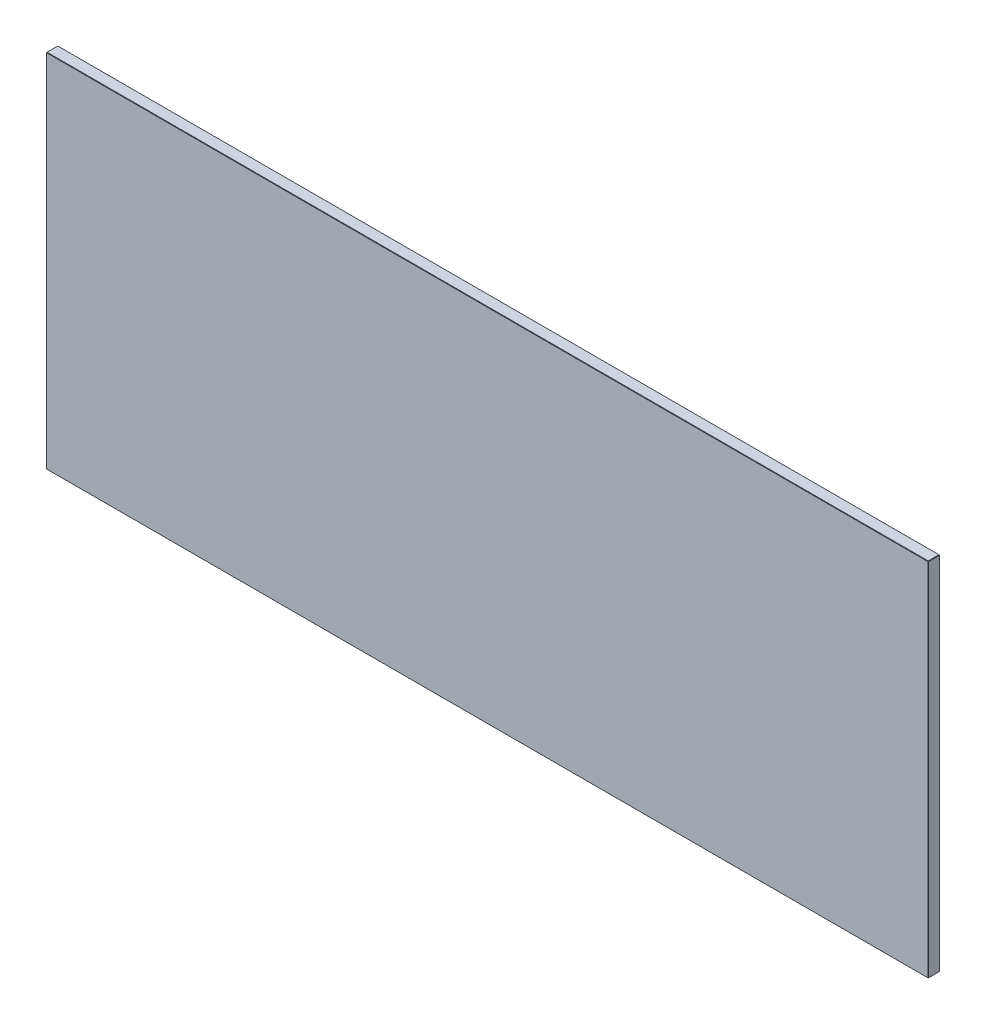
ISO-10303-21;
HEADER;
FILE_DESCRIPTION(('STEP AP214'),'2;1');
FILE_NAME('part.step','',(''),(''),'','','');
FILE_SCHEMA(('AUTOMOTIVE_DESIGN { 1 0 10303 214 1 1 1 1 }'));
ENDSEC;
DATA;
#1=APPLICATION_CONTEXT('core data for automotive mechanical design processes');
#2=APPLICATION_PROTOCOL_DEFINITION('international standard','automotive_design',2000,#1);
#3=PRODUCT_CONTEXT('',#1,'mechanical');
#4=PRODUCT('Part','Part','',(#3));
#5=PRODUCT_RELATED_PRODUCT_CATEGORY('part','',(#4));
#6=PRODUCT_DEFINITION_FORMATION('','',#4);
#7=PRODUCT_DEFINITION_CONTEXT('part definition',#1,'design');
#8=PRODUCT_DEFINITION('design','',#6,#7);
#9=PRODUCT_DEFINITION_SHAPE('','',#8);
#10=(LENGTH_UNIT() NAMED_UNIT(*) SI_UNIT(.MILLI.,.METRE.));
#11=(NAMED_UNIT(*) PLANE_ANGLE_UNIT() SI_UNIT($,.RADIAN.));
#12=(NAMED_UNIT(*) SI_UNIT($,.STERADIAN.) SOLID_ANGLE_UNIT());
#13=UNCERTAINTY_MEASURE_WITH_UNIT(LENGTH_MEASURE(1.E-05),#10,'distance_accuracy_value','');
#14=(GEOMETRIC_REPRESENTATION_CONTEXT(3) GLOBAL_UNCERTAINTY_ASSIGNED_CONTEXT((#13)) GLOBAL_UNIT_ASSIGNED_CONTEXT((#10,
#11,#12)) REPRESENTATION_CONTEXT('',''));
#15=CARTESIAN_POINT('',(0.,0.,0.));
#16=DIRECTION('',(0.,0.,1.));
#17=DIRECTION('',(1.,0.,0.));
#18=AXIS2_PLACEMENT_3D('',#15,#16,#17);
#19=CARTESIAN_POINT('',(-692.416966362225,-282.771335912594,9.5));
#20=DIRECTION('',(1.,0.,0.));
#21=DIRECTION('',(0.,0.,-1.));
#22=AXIS2_PLACEMENT_3D('',#19,#20,#21);
#23=PLANE('',#22);
#24=DIRECTION('',(0.,0.,-1.));
#25=VECTOR('',#24,1.);
#26=CARTESIAN_POINT('',(-692.416966362225,16.9286640874057,9.5));
#27=LINE('',#26,#25);
#28=CARTESIAN_POINT('',(-692.416966362225,16.9286640874057,9.19999999999992));
#29=VERTEX_POINT('',#28);
#30=CARTESIAN_POINT('',(-692.416966362225,16.9286640874057,0.300000000000078));
#31=VERTEX_POINT('',#30);
#32=EDGE_CURVE('E126',#29,#31,#27,.T.);
#33=ORIENTED_EDGE('',*,*,#32,.T.);
#34=DIRECTION('',(0.,-1.,0.));
#35=VECTOR('',#34,1.);
#36=CARTESIAN_POINT('',(-692.416966362225,-282.771335912594,0.300000000000078));
#37=LINE('',#36,#35);
#38=CARTESIAN_POINT('',(-692.416966362225,-282.471335912594,0.300000000000078));
#39=VERTEX_POINT('',#38);
#40=EDGE_CURVE('E160',#31,#39,#37,.T.);
#41=ORIENTED_EDGE('',*,*,#40,.T.);
#42=DIRECTION('',(0.,0.,1.));
#43=VECTOR('',#42,1.);
#44=CARTESIAN_POINT('',(-692.416966362225,-282.471335912594,9.5));
#45=LINE('',#44,#43);
#46=CARTESIAN_POINT('',(-692.416966362225,-282.471335912594,9.19999999999992));
#47=VERTEX_POINT('',#46);
#48=EDGE_CURVE('E129',#39,#47,#45,.T.);
#49=ORIENTED_EDGE('',*,*,#48,.T.);
#50=DIRECTION('',(0.,1.,0.));
#51=VECTOR('',#50,1.);
#52=CARTESIAN_POINT('',(-692.416966362225,-282.771335912594,9.19999999999992));
#53=LINE('',#52,#51);
#54=EDGE_CURVE('E122',#47,#29,#53,.T.);
#55=ORIENTED_EDGE('',*,*,#54,.T.);
#56=EDGE_LOOP('',(#33,#41,#49,#55));
#57=FACE_BOUND('',#56,.T.);
#58=ADVANCED_FACE('F35',(#57),#23,.F.);
#59=CARTESIAN_POINT('',(-692.416966362225,-282.771335912594,9.5));
#60=DIRECTION('',(0.,1.,0.));
#61=DIRECTION('',(0.,0.,1.));
#62=AXIS2_PLACEMENT_3D('',#59,#60,#61);
#63=PLANE('',#62);
#64=DIRECTION('',(0.,0.,-1.));
#65=VECTOR('',#64,1.);
#66=CARTESIAN_POINT('',(-692.116966362225,-282.771335912594,9.5));
#67=LINE('',#66,#65);
#68=CARTESIAN_POINT('',(-692.116966362225,-282.771335912594,9.20000000000003));
#69=VERTEX_POINT('',#68);
#70=CARTESIAN_POINT('',(-692.116966362225,-282.771335912594,0.300000000000078));
#71=VERTEX_POINT('',#70);
#72=EDGE_CURVE('E171',#69,#71,#67,.T.);
#73=ORIENTED_EDGE('',*,*,#72,.T.);
#74=DIRECTION('',(1.,0.,0.));
#75=VECTOR('',#74,1.);
#76=CARTESIAN_POINT('',(40.0830336377748,-282.771335912594,0.300000000000078));
#77=LINE('',#76,#75);
#78=CARTESIAN_POINT('',(39.7830336377748,-282.771335912594,0.300000000000078));
#79=VERTEX_POINT('',#78);
#80=EDGE_CURVE('E177',#71,#79,#77,.T.);
#81=ORIENTED_EDGE('',*,*,#80,.T.);
#82=DIRECTION('',(0.,0.,1.));
#83=VECTOR('',#82,1.);
#84=CARTESIAN_POINT('',(39.7830336377748,-282.771335912594,9.5));
#85=LINE('',#84,#83);
#86=CARTESIAN_POINT('',(39.7830336377748,-282.771335912594,9.20000000000003));
#87=VERTEX_POINT('',#86);
#88=EDGE_CURVE('E175',#79,#87,#85,.T.);
#89=ORIENTED_EDGE('',*,*,#88,.T.);
#90=DIRECTION('',(-1.,0.,0.));
#91=VECTOR('',#90,1.);
#92=CARTESIAN_POINT('',(-692.416966362225,-282.771335912594,9.20000000000003));
#93=LINE('',#92,#91);
#94=EDGE_CURVE('E173',#87,#69,#93,.T.);
#95=ORIENTED_EDGE('',*,*,#94,.T.);
#96=EDGE_LOOP('',(#73,#81,#89,#95));
#97=FACE_BOUND('',#96,.T.);
#98=ADVANCED_FACE('F264',(#97),#63,.F.);
#99=CARTESIAN_POINT('',(40.0830336377748,-282.771335912594,9.5));
#100=DIRECTION('',(-1.,0.,0.));
#101=DIRECTION('',(0.,-1.,0.));
#102=AXIS2_PLACEMENT_3D('',#99,#100,#101);
#103=PLANE('',#102);
#104=DIRECTION('',(0.,-1.,0.));
#105=VECTOR('',#104,1.);
#106=CARTESIAN_POINT('',(40.0830336377748,-282.771335912594,9.20000000000003));
#107=LINE('',#106,#105);
#108=CARTESIAN_POINT('',(40.0830336377748,16.9286640874057,9.20000000000003));
#109=VERTEX_POINT('',#108);
#110=CARTESIAN_POINT('',(40.0830336377748,-282.471335912594,9.20000000000003));
#111=VERTEX_POINT('',#110);
#112=EDGE_CURVE('E191',#109,#111,#107,.T.);
#113=ORIENTED_EDGE('',*,*,#112,.T.);
#114=DIRECTION('',(0.,0.,-1.));
#115=VECTOR('',#114,1.);
#116=CARTESIAN_POINT('',(40.0830336377748,-282.471335912594,9.5));
#117=LINE('',#116,#115);
#118=CARTESIAN_POINT('',(40.0830336377748,-282.471335912594,0.300000000000078));
#119=VERTEX_POINT('',#118);
#120=EDGE_CURVE('E196',#111,#119,#117,.T.);
#121=ORIENTED_EDGE('',*,*,#120,.T.);
#122=DIRECTION('',(0.,1.,0.));
#123=VECTOR('',#122,1.);
#124=CARTESIAN_POINT('',(40.0830336377748,17.2286640874058,0.300000000000078));
#125=LINE('',#124,#123);
#126=CARTESIAN_POINT('',(40.0830336377748,16.9286640874057,0.300000000000078));
#127=VERTEX_POINT('',#126);
#128=EDGE_CURVE('E193',#119,#127,#125,.T.);
#129=ORIENTED_EDGE('',*,*,#128,.T.);
#130=DIRECTION('',(0.,0.,1.));
#131=VECTOR('',#130,1.);
#132=CARTESIAN_POINT('',(40.0830336377748,16.9286640874057,9.5));
#133=LINE('',#132,#131);
#134=EDGE_CURVE('E189',#127,#109,#133,.T.);
#135=ORIENTED_EDGE('',*,*,#134,.T.);
#136=EDGE_LOOP('',(#113,#121,#129,#135));
#137=FACE_BOUND('',#136,.T.);
#138=ADVANCED_FACE('F273',(#137),#103,.F.);
#139=CARTESIAN_POINT('',(-692.416966362225,17.2286640874058,9.5));
#140=DIRECTION('',(0.,-1.,0.));
#141=DIRECTION('',(0.,0.,-1.));
#142=AXIS2_PLACEMENT_3D('',#139,#140,#141);
#143=PLANE('',#142);
#144=DIRECTION('',(0.,0.,-1.));
#145=VECTOR('',#144,1.);
#146=CARTESIAN_POINT('',(39.7830336377748,17.2286640874058,9.5));
#147=LINE('',#146,#145);
#148=CARTESIAN_POINT('',(39.7830336377748,17.2286640874058,9.20000000000003));
#149=VERTEX_POINT('',#148);
#150=CARTESIAN_POINT('',(39.7830336377748,17.2286640874058,0.299999999999967));
#151=VERTEX_POINT('',#150);
#152=EDGE_CURVE('E184',#149,#151,#147,.T.);
#153=ORIENTED_EDGE('',*,*,#152,.T.);
#154=DIRECTION('',(-1.,0.,0.));
#155=VECTOR('',#154,1.);
#156=CARTESIAN_POINT('',(-692.416966362225,17.2286640874058,0.299999999999967));
#157=LINE('',#156,#155);
#158=CARTESIAN_POINT('',(-692.116966362225,17.2286640874058,0.299999999999967));
#159=VERTEX_POINT('',#158);
#160=EDGE_CURVE('E186',#151,#159,#157,.T.);
#161=ORIENTED_EDGE('',*,*,#160,.T.);
#162=DIRECTION('',(0.,0.,1.));
#163=VECTOR('',#162,1.);
#164=CARTESIAN_POINT('',(-692.116966362225,17.2286640874058,9.5));
#165=LINE('',#164,#163);
#166=CARTESIAN_POINT('',(-692.116966362225,17.2286640874058,9.20000000000003));
#167=VERTEX_POINT('',#166);
#168=EDGE_CURVE('E180',#159,#167,#165,.T.);
#169=ORIENTED_EDGE('',*,*,#168,.T.);
#170=DIRECTION('',(1.,0.,0.));
#171=VECTOR('',#170,1.);
#172=CARTESIAN_POINT('',(-692.416966362225,17.2286640874058,9.20000000000003));
#173=LINE('',#172,#171);
#174=EDGE_CURVE('E182',#167,#149,#173,.T.);
#175=ORIENTED_EDGE('',*,*,#174,.T.);
#176=EDGE_LOOP('',(#153,#161,#169,#175));
#177=FACE_BOUND('',#176,.T.);
#178=ADVANCED_FACE('F298',(#177),#143,.F.);
#179=CARTESIAN_POINT('',(0.,0.,9.5));
#180=DIRECTION('',(0.,0.,-1.));
#181=DIRECTION('',(-1.,0.,0.));
#182=AXIS2_PLACEMENT_3D('',#179,#180,#181);
#183=PLANE('',#182);
#184=DIRECTION('',(1.,0.,0.));
#185=VECTOR('',#184,1.);
#186=CARTESIAN_POINT('',(0.,-282.471335912594,9.5));
#187=LINE('',#186,#185);
#188=CARTESIAN_POINT('',(-692.116966362225,-282.471335912594,9.5));
#189=VERTEX_POINT('',#188);
#190=CARTESIAN_POINT('',(39.7830336377747,-282.471335912594,9.5));
#191=VERTEX_POINT('',#190);
#192=EDGE_CURVE('E44',#189,#191,#187,.T.);
#193=ORIENTED_EDGE('',*,*,#192,.T.);
#194=DIRECTION('',(0.,1.,0.));
#195=VECTOR('',#194,1.);
#196=CARTESIAN_POINT('',(39.7830336377747,0.,9.5));
#197=LINE('',#196,#195);
#198=CARTESIAN_POINT('',(39.7830336377747,16.9286640874057,9.5));
#199=VERTEX_POINT('',#198);
#200=EDGE_CURVE('E11',#191,#199,#197,.T.);
#201=ORIENTED_EDGE('',*,*,#200,.T.);
#202=DIRECTION('',(-1.,0.,0.));
#203=VECTOR('',#202,1.);
#204=CARTESIAN_POINT('',(0.,16.9286640874057,9.5));
#205=LINE('',#204,#203);
#206=CARTESIAN_POINT('',(-692.116966362225,16.9286640874057,9.5));
#207=VERTEX_POINT('',#206);
#208=EDGE_CURVE('E198',#199,#207,#205,.T.);
#209=ORIENTED_EDGE('',*,*,#208,.T.);
#210=DIRECTION('',(0.,-1.,0.));
#211=VECTOR('',#210,1.);
#212=CARTESIAN_POINT('',(-692.116966362225,0.,9.5));
#213=LINE('',#212,#211);
#214=EDGE_CURVE('E55',#207,#189,#213,.T.);
#215=ORIENTED_EDGE('',*,*,#214,.T.);
#216=EDGE_LOOP('',(#193,#201,#209,#215));
#217=FACE_BOUND('',#216,.T.);
#218=ADVANCED_FACE('F295',(#217),#183,.F.);
#219=CARTESIAN_POINT('',(0.,0.,0.));
#220=DIRECTION('',(0.,0.,-1.));
#221=DIRECTION('',(-1.,0.,0.));
#222=AXIS2_PLACEMENT_3D('',#219,#220,#221);
#223=PLANE('',#222);
#224=DIRECTION('',(-1.,0.,0.));
#225=VECTOR('',#224,1.);
#226=CARTESIAN_POINT('',(-692.416966362225,-282.471335912594,0.));
#227=LINE('',#226,#225);
#228=CARTESIAN_POINT('',(39.7830336377748,-282.471335912594,0.));
#229=VERTEX_POINT('',#228);
#230=CARTESIAN_POINT('',(-692.116966362225,-282.471335912594,0.));
#231=VERTEX_POINT('',#230);
#232=EDGE_CURVE('E166',#229,#231,#227,.T.);
#233=ORIENTED_EDGE('',*,*,#232,.T.);
#234=DIRECTION('',(0.,1.,0.));
#235=VECTOR('',#234,1.);
#236=CARTESIAN_POINT('',(-692.116966362225,17.2286640874058,0.));
#237=LINE('',#236,#235);
#238=CARTESIAN_POINT('',(-692.116966362225,16.9286640874057,0.));
#239=VERTEX_POINT('',#238);
#240=EDGE_CURVE('E168',#231,#239,#237,.T.);
#241=ORIENTED_EDGE('',*,*,#240,.T.);
#242=DIRECTION('',(1.,0.,0.));
#243=VECTOR('',#242,1.);
#244=CARTESIAN_POINT('',(40.0830336377748,16.9286640874057,0.));
#245=LINE('',#244,#243);
#246=CARTESIAN_POINT('',(39.7830336377748,16.9286640874057,0.));
#247=VERTEX_POINT('',#246);
#248=EDGE_CURVE('E164',#239,#247,#245,.T.);
#249=ORIENTED_EDGE('',*,*,#248,.T.);
#250=DIRECTION('',(0.,-1.,0.));
#251=VECTOR('',#250,1.);
#252=CARTESIAN_POINT('',(39.7830336377748,-282.771335912594,0.));
#253=LINE('',#252,#251);
#254=EDGE_CURVE('E162',#247,#229,#253,.T.);
#255=ORIENTED_EDGE('',*,*,#254,.T.);
#256=EDGE_LOOP('',(#233,#241,#249,#255));
#257=FACE_BOUND('',#256,.T.);
#258=ADVANCED_FACE('F297',(#257),#223,.T.);
#259=CARTESIAN_POINT('',(39.7830336377747,0.,9.5));
#260=DIRECTION('',(-0.707106781186408,0.,-0.707106781186687));
#261=DIRECTION('',(0.,1.,0.));
#262=AXIS2_PLACEMENT_3D('',#259,#260,#261);
#263=PLANE('',#262);
#264=DIRECTION('',(-0.707106781186687,0.,0.707106781186408));
#265=VECTOR('',#264,1.);
#266=CARTESIAN_POINT('',(39.7830336377747,16.9286640874057,9.5));
#267=LINE('',#266,#265);
#268=EDGE_CURVE('E39',#199,#109,#267,.F.);
#269=ORIENTED_EDGE('',*,*,#268,.F.);
#270=ORIENTED_EDGE('',*,*,#200,.F.);
#271=DIRECTION('',(0.707106781186687,0.,-0.707106781186408));
#272=VECTOR('',#271,1.);
#273=CARTESIAN_POINT('',(40.0830336377748,-282.471335912594,9.20000000000003));
#274=LINE('',#273,#272);
#275=EDGE_CURVE('E157',#111,#191,#274,.F.);
#276=ORIENTED_EDGE('',*,*,#275,.F.);
#277=ORIENTED_EDGE('',*,*,#112,.F.);
#278=EDGE_LOOP('',(#269,#270,#276,#277));
#279=FACE_BOUND('',#278,.T.);
#280=ADVANCED_FACE('F37',(#279),#263,.F.);
#281=CARTESIAN_POINT('',(39.7830336377747,16.9286640874057,9.5));
#282=DIRECTION('',(0.577350269189626,0.577350269189419,0.577350269189833));
#283=DIRECTION('',(0.707106781186674,0.,-0.707106781186421));
#284=AXIS2_PLACEMENT_3D('',#281,#282,#283);
#285=PLANE('',#284);
#286=DIRECTION('',(2.45397794358158E-13,0.707106781186678,-0.707106781186417));
#287=VECTOR('',#286,1.);
#288=CARTESIAN_POINT('',(39.7830336377747,16.9286640874057,9.5));
#289=LINE('',#288,#287);
#290=EDGE_CURVE('E244',#199,#149,#289,.T.);
#291=ORIENTED_EDGE('',*,*,#290,.F.);
#292=ORIENTED_EDGE('',*,*,#268,.T.);
#293=DIRECTION('',(0.707106781186421,-0.707106781186674,0.));
#294=VECTOR('',#293,1.);
#295=CARTESIAN_POINT('',(39.9330336377748,17.0786640874057,9.20000000000003));
#296=LINE('',#295,#294);
#297=EDGE_CURVE('E247',#149,#109,#296,.T.);
#298=ORIENTED_EDGE('',*,*,#297,.F.);
#299=EDGE_LOOP('',(#291,#292,#298));
#300=FACE_BOUND('',#299,.T.);
#301=ADVANCED_FACE('F291',(#300),#285,.T.);
#302=CARTESIAN_POINT('',(40.0830336377748,-282.471335912594,9.20000000000003));
#303=DIRECTION('',(0.577350269189608,-0.577350269189434,0.577350269189835));
#304=DIRECTION('',(0.707106781186687,0.,-0.707106781186408));
#305=AXIS2_PLACEMENT_3D('',#302,#303,#304);
#306=PLANE('',#305);
#307=DIRECTION('',(-0.707106781186441,-0.707106781186654,0.));
#308=VECTOR('',#307,1.);
#309=CARTESIAN_POINT('',(40.0830336377748,-282.471335912594,9.20000000000003));
#310=LINE('',#309,#308);
#311=EDGE_CURVE('E238',#111,#87,#310,.T.);
#312=ORIENTED_EDGE('',*,*,#311,.F.);
#313=ORIENTED_EDGE('',*,*,#275,.T.);
#314=DIRECTION('',(-2.2902485594829E-13,0.707106781186678,0.707106781186417));
#315=VECTOR('',#314,1.);
#316=CARTESIAN_POINT('',(39.7830336377747,-282.621335912594,9.35000000000002));
#317=LINE('',#316,#315);
#318=EDGE_CURVE('E241',#87,#191,#317,.T.);
#319=ORIENTED_EDGE('',*,*,#318,.F.);
#320=EDGE_LOOP('',(#312,#313,#319));
#321=FACE_BOUND('',#320,.T.);
#322=ADVANCED_FACE('F254',(#321),#306,.T.);
#323=CARTESIAN_POINT('',(39.7830336377748,17.2286640874058,9.5));
#324=DIRECTION('',(-0.707106781186674,-0.707106781186421,0.));
#325=DIRECTION('',(0.,0.,-1.));
#326=AXIS2_PLACEMENT_3D('',#323,#324,#325);
#327=PLANE('',#326);
#328=ORIENTED_EDGE('',*,*,#297,.T.);
#329=ORIENTED_EDGE('',*,*,#134,.F.);
#330=DIRECTION('',(-0.707106781186421,0.707106781186674,-2.61620734239299E-13));
#331=VECTOR('',#330,1.);
#332=CARTESIAN_POINT('',(39.9330336377748,17.0786640874057,0.300000000000023));
#333=LINE('',#332,#331);
#334=EDGE_CURVE('E233',#151,#127,#333,.F.);
#335=ORIENTED_EDGE('',*,*,#334,.F.);
#336=ORIENTED_EDGE('',*,*,#152,.F.);
#337=EDGE_LOOP('',(#328,#329,#335,#336));
#338=FACE_BOUND('',#337,.T.);
#339=ADVANCED_FACE('F285',(#338),#327,.F.);
#340=CARTESIAN_POINT('',(0.,16.9286640874057,9.5));
#341=DIRECTION('',(0.,-0.707106781186417,-0.707106781186678));
#342=DIRECTION('',(-1.,0.,0.));
#343=AXIS2_PLACEMENT_3D('',#340,#341,#342);
#344=PLANE('',#343);
#345=ORIENTED_EDGE('',*,*,#290,.T.);
#346=ORIENTED_EDGE('',*,*,#174,.F.);
#347=DIRECTION('',(0.,-0.707106781186678,0.707106781186417));
#348=VECTOR('',#347,1.);
#349=CARTESIAN_POINT('',(-692.116966362225,17.0786640874057,9.35000000000002));
#350=LINE('',#349,#348);
#351=EDGE_CURVE('E141',#207,#167,#350,.F.);
#352=ORIENTED_EDGE('',*,*,#351,.F.);
#353=ORIENTED_EDGE('',*,*,#208,.F.);
#354=EDGE_LOOP('',(#345,#346,#352,#353));
#355=FACE_BOUND('',#354,.T.);
#356=ADVANCED_FACE('F294',(#355),#344,.F.);
#357=CARTESIAN_POINT('',(-692.116966362225,0.,9.5));
#358=DIRECTION('',(0.707106781186678,0.,-0.707106781186417));
#359=DIRECTION('',(0.,-1.,0.));
#360=AXIS2_PLACEMENT_3D('',#357,#358,#359);
#361=PLANE('',#360);
#362=DIRECTION('',(0.707106781186417,0.,0.707106781186678));
#363=VECTOR('',#362,1.);
#364=CARTESIAN_POINT('',(-692.266966362225,-282.471335912594,9.34999999999996));
#365=LINE('',#364,#363);
#366=EDGE_CURVE('E142',#189,#47,#365,.F.);
#367=ORIENTED_EDGE('',*,*,#366,.F.);
#368=ORIENTED_EDGE('',*,*,#214,.F.);
#369=DIRECTION('',(-0.707106781186417,0.,-0.707106781186678));
#370=VECTOR('',#369,1.);
#371=CARTESIAN_POINT('',(-692.416966362225,16.9286640874057,9.19999999999992));
#372=LINE('',#371,#370);
#373=EDGE_CURVE('E135',#29,#207,#372,.F.);
#374=ORIENTED_EDGE('',*,*,#373,.F.);
#375=ORIENTED_EDGE('',*,*,#54,.F.);
#376=EDGE_LOOP('',(#367,#368,#374,#375));
#377=FACE_BOUND('',#376,.T.);
#378=ADVANCED_FACE('F137',(#377),#361,.F.);
#379=CARTESIAN_POINT('',(0.,-282.471335912594,9.5));
#380=DIRECTION('',(0.,0.707106781186417,-0.707106781186678));
#381=DIRECTION('',(1.,0.,0.));
#382=AXIS2_PLACEMENT_3D('',#379,#380,#381);
#383=PLANE('',#382);
#384=ORIENTED_EDGE('',*,*,#318,.T.);
#385=ORIENTED_EDGE('',*,*,#192,.F.);
#386=DIRECTION('',(0.,-0.707106781186678,-0.707106781186417));
#387=VECTOR('',#386,1.);
#388=CARTESIAN_POINT('',(-692.116966362225,-282.771335912594,9.20000000000003));
#389=LINE('',#388,#387);
#390=EDGE_CURVE('E228',#69,#189,#389,.F.);
#391=ORIENTED_EDGE('',*,*,#390,.F.);
#392=ORIENTED_EDGE('',*,*,#94,.F.);
#393=EDGE_LOOP('',(#384,#385,#391,#392));
#394=FACE_BOUND('',#393,.T.);
#395=ADVANCED_FACE('F260',(#394),#383,.F.);
#396=CARTESIAN_POINT('',(40.0830336377748,-282.471335912594,9.5));
#397=DIRECTION('',(-0.707106781186654,0.707106781186441,0.));
#398=DIRECTION('',(0.,0.,-1.));
#399=AXIS2_PLACEMENT_3D('',#396,#397,#398);
#400=PLANE('',#399);
#401=ORIENTED_EDGE('',*,*,#311,.T.);
#402=ORIENTED_EDGE('',*,*,#88,.F.);
#403=DIRECTION('',(0.707106781186441,0.707106781186654,0.));
#404=VECTOR('',#403,1.);
#405=CARTESIAN_POINT('',(39.7830336377748,-282.771335912594,0.300000000000078));
#406=LINE('',#405,#404);
#407=EDGE_CURVE('E225',#119,#79,#406,.F.);
#408=ORIENTED_EDGE('',*,*,#407,.F.);
#409=ORIENTED_EDGE('',*,*,#120,.F.);
#410=EDGE_LOOP('',(#401,#402,#408,#409));
#411=FACE_BOUND('',#410,.T.);
#412=ADVANCED_FACE('F270',(#411),#400,.F.);
#413=CARTESIAN_POINT('',(40.0830336377748,-282.771335912594,0.300000000000078));
#414=DIRECTION('',(0.70710678118667,0.,-0.707106781186425));
#415=DIRECTION('',(0.,-1.,0.));
#416=AXIS2_PLACEMENT_3D('',#413,#414,#415);
#417=PLANE('',#416);
#418=DIRECTION('',(-0.707106781186425,0.,-0.70710678118667));
#419=VECTOR('',#418,1.);
#420=CARTESIAN_POINT('',(39.7830336377748,16.9286640874057,0.));
#421=LINE('',#420,#419);
#422=EDGE_CURVE('E235',#127,#247,#421,.T.);
#423=ORIENTED_EDGE('',*,*,#422,.F.);
#424=ORIENTED_EDGE('',*,*,#128,.F.);
#425=DIRECTION('',(0.707106781186425,2.62608310401281E-13,0.70710678118667));
#426=VECTOR('',#425,1.);
#427=CARTESIAN_POINT('',(39.9330336377748,-282.471335912594,0.150000000000028));
#428=LINE('',#427,#426);
#429=EDGE_CURVE('E222',#229,#119,#428,.T.);
#430=ORIENTED_EDGE('',*,*,#429,.F.);
#431=ORIENTED_EDGE('',*,*,#254,.F.);
#432=EDGE_LOOP('',(#423,#424,#430,#431));
#433=FACE_BOUND('',#432,.T.);
#434=ADVANCED_FACE('F277',(#433),#417,.T.);
#435=CARTESIAN_POINT('',(39.7830336377748,16.9286640874057,0.));
#436=DIRECTION('',(0.577350269189839,0.577350269189419,-0.577350269189619));
#437=DIRECTION('',(-0.707106781186413,0.,-0.707106781186682));
#438=AXIS2_PLACEMENT_3D('',#435,#436,#437);
#439=PLANE('',#438);
#440=ORIENTED_EDGE('',*,*,#334,.T.);
#441=ORIENTED_EDGE('',*,*,#422,.T.);
#442=DIRECTION('',(0.,0.707106781186678,0.707106781186417));
#443=VECTOR('',#442,1.);
#444=CARTESIAN_POINT('',(39.7830336377748,16.9286640874057,0.));
#445=LINE('',#444,#443);
#446=EDGE_CURVE('E149',#151,#247,#445,.F.);
#447=ORIENTED_EDGE('',*,*,#446,.F.);
#448=EDGE_LOOP('',(#440,#441,#447));
#449=FACE_BOUND('',#448,.T.);
#450=ADVANCED_FACE('F352',(#449),#439,.T.);
#451=CARTESIAN_POINT('',(-692.416966362225,16.9286640874057,9.19999999999992));
#452=DIRECTION('',(-0.577350269189853,0.577350269189405,0.577350269189619));
#453=DIRECTION('',(0.707106781186404,0.,0.707106781186691));
#454=AXIS2_PLACEMENT_3D('',#451,#452,#453);
#455=PLANE('',#454);
#456=ORIENTED_EDGE('',*,*,#373,.T.);
#457=ORIENTED_EDGE('',*,*,#351,.T.);
#458=DIRECTION('',(0.707106781186404,0.707106781186691,2.61620734239299E-13));
#459=VECTOR('',#458,1.);
#460=CARTESIAN_POINT('',(-692.416966362225,16.9286640874057,9.19999999999992));
#461=LINE('',#460,#459);
#462=EDGE_CURVE('E145',#29,#167,#461,.T.);
#463=ORIENTED_EDGE('',*,*,#462,.F.);
#464=EDGE_LOOP('',(#456,#457,#463));
#465=FACE_BOUND('',#464,.T.);
#466=ADVANCED_FACE('F146',(#465),#455,.T.);
#467=CARTESIAN_POINT('',(-692.116966362225,-282.771335912594,9.20000000000003));
#468=DIRECTION('',(-0.577350269189839,-0.577350269189412,0.577350269189626));
#469=DIRECTION('',(0.707106781186417,0.,0.707106781186678));
#470=AXIS2_PLACEMENT_3D('',#467,#468,#469);
#471=PLANE('',#470);
#472=ORIENTED_EDGE('',*,*,#390,.T.);
#473=ORIENTED_EDGE('',*,*,#366,.T.);
#474=DIRECTION('',(-0.707106781186417,0.707106781186678,-2.61712588571124E-13));
#475=VECTOR('',#474,1.);
#476=CARTESIAN_POINT('',(-692.116966362225,-282.771335912594,9.20000000000003));
#477=LINE('',#476,#475);
#478=EDGE_CURVE('E150',#69,#47,#477,.T.);
#479=ORIENTED_EDGE('',*,*,#478,.F.);
#480=EDGE_LOOP('',(#472,#473,#479));
#481=FACE_BOUND('',#480,.T.);
#482=ADVANCED_FACE('F345',(#481),#471,.T.);
#483=CARTESIAN_POINT('',(39.7830336377748,-282.771335912594,0.300000000000078));
#484=DIRECTION('',(0.577350269189822,-0.577350269189648,-0.577350269189408));
#485=DIRECTION('',(0.707106781186441,0.707106781186654,0.));
#486=AXIS2_PLACEMENT_3D('',#483,#484,#485);
#487=PLANE('',#486);
#488=ORIENTED_EDGE('',*,*,#429,.T.);
#489=ORIENTED_EDGE('',*,*,#407,.T.);
#490=DIRECTION('',(0.,0.707106781186417,-0.707106781186678));
#491=VECTOR('',#490,1.);
#492=CARTESIAN_POINT('',(39.7830336377748,-282.771335912594,0.300000000000078));
#493=LINE('',#492,#491);
#494=EDGE_CURVE('E216',#229,#79,#493,.F.);
#495=ORIENTED_EDGE('',*,*,#494,.F.);
#496=EDGE_LOOP('',(#488,#489,#495));
#497=FACE_BOUND('',#496,.T.);
#498=ADVANCED_FACE('F341',(#497),#487,.T.);
#499=CARTESIAN_POINT('',(-692.416966362225,17.2286640874058,0.299999999999967));
#500=DIRECTION('',(0.,0.707106781186417,-0.707106781186678));
#501=DIRECTION('',(1.,0.,0.));
#502=AXIS2_PLACEMENT_3D('',#499,#500,#501);
#503=PLANE('',#502);
#504=ORIENTED_EDGE('',*,*,#446,.T.);
#505=ORIENTED_EDGE('',*,*,#248,.F.);
#506=DIRECTION('',(0.,-0.707106781186678,-0.707106781186417));
#507=VECTOR('',#506,1.);
#508=CARTESIAN_POINT('',(-692.116966362225,16.9286640874057,0.));
#509=LINE('',#508,#507);
#510=EDGE_CURVE('E213',#159,#239,#509,.T.);
#511=ORIENTED_EDGE('',*,*,#510,.F.);
#512=ORIENTED_EDGE('',*,*,#160,.F.);
#513=EDGE_LOOP('',(#504,#505,#511,#512));
#514=FACE_BOUND('',#513,.T.);
#515=ADVANCED_FACE('F338',(#514),#503,.T.);
#516=CARTESIAN_POINT('',(-692.416966362225,16.9286640874057,9.5));
#517=DIRECTION('',(0.707106781186691,-0.707106781186404,0.));
#518=DIRECTION('',(0.,0.,-1.));
#519=AXIS2_PLACEMENT_3D('',#516,#517,#518);
#520=PLANE('',#519);
#521=ORIENTED_EDGE('',*,*,#462,.T.);
#522=ORIENTED_EDGE('',*,*,#168,.F.);
#523=DIRECTION('',(-0.707106781186404,-0.707106781186691,2.61620734239299E-13));
#524=VECTOR('',#523,1.);
#525=CARTESIAN_POINT('',(-692.266966362225,17.0786640874057,0.300000000000022));
#526=LINE('',#525,#524);
#527=EDGE_CURVE('E153',#31,#159,#526,.F.);
#528=ORIENTED_EDGE('',*,*,#527,.F.);
#529=ORIENTED_EDGE('',*,*,#32,.F.);
#530=EDGE_LOOP('',(#521,#522,#528,#529));
#531=FACE_BOUND('',#530,.T.);
#532=ADVANCED_FACE('F152',(#531),#520,.F.);
#533=CARTESIAN_POINT('',(-692.116966362225,-282.771335912594,9.5));
#534=DIRECTION('',(0.707106781186678,0.707106781186417,0.));
#535=DIRECTION('',(0.,0.,-1.));
#536=AXIS2_PLACEMENT_3D('',#533,#534,#535);
#537=PLANE('',#536);
#538=ORIENTED_EDGE('',*,*,#478,.T.);
#539=ORIENTED_EDGE('',*,*,#48,.F.);
#540=DIRECTION('',(0.707106781186417,-0.707106781186678,0.));
#541=VECTOR('',#540,1.);
#542=CARTESIAN_POINT('',(-692.416966362225,-282.471335912594,0.300000000000078));
#543=LINE('',#542,#541);
#544=EDGE_CURVE('E209',#71,#39,#543,.F.);
#545=ORIENTED_EDGE('',*,*,#544,.F.);
#546=ORIENTED_EDGE('',*,*,#72,.F.);
#547=EDGE_LOOP('',(#538,#539,#545,#546));
#548=FACE_BOUND('',#547,.T.);
#549=ADVANCED_FACE('F331',(#548),#537,.F.);
#550=CARTESIAN_POINT('',(-692.416966362225,-282.771335912594,0.300000000000078));
#551=DIRECTION('',(0.,-0.707106781186678,-0.707106781186417));
#552=DIRECTION('',(-1.,0.,0.));
#553=AXIS2_PLACEMENT_3D('',#550,#551,#552);
#554=PLANE('',#553);
#555=ORIENTED_EDGE('',*,*,#494,.T.);
#556=ORIENTED_EDGE('',*,*,#80,.F.);
#557=DIRECTION('',(0.,-0.707106781186417,0.707106781186678));
#558=VECTOR('',#557,1.);
#559=CARTESIAN_POINT('',(-692.116966362225,-282.621335912594,0.150000000000039));
#560=LINE('',#559,#558);
#561=EDGE_CURVE('E206',#231,#71,#560,.T.);
#562=ORIENTED_EDGE('',*,*,#561,.F.);
#563=ORIENTED_EDGE('',*,*,#232,.F.);
#564=EDGE_LOOP('',(#555,#556,#562,#563));
#565=FACE_BOUND('',#564,.T.);
#566=ADVANCED_FACE('F327',(#565),#554,.T.);
#567=CARTESIAN_POINT('',(-692.116966362225,16.9286640874057,0.));
#568=DIRECTION('',(-0.577350269189853,0.577350269189405,-0.577350269189619));
#569=DIRECTION('',(-0.707106781186404,0.,0.707106781186691));
#570=AXIS2_PLACEMENT_3D('',#567,#568,#569);
#571=PLANE('',#570);
#572=ORIENTED_EDGE('',*,*,#527,.T.);
#573=ORIENTED_EDGE('',*,*,#510,.T.);
#574=DIRECTION('',(-0.707106781186417,0.,0.707106781186678));
#575=VECTOR('',#574,1.);
#576=CARTESIAN_POINT('',(-692.116966362225,16.9286640874057,0.));
#577=LINE('',#576,#575);
#578=EDGE_CURVE('E204',#31,#239,#577,.F.);
#579=ORIENTED_EDGE('',*,*,#578,.F.);
#580=EDGE_LOOP('',(#572,#573,#579));
#581=FACE_BOUND('',#580,.T.);
#582=ADVANCED_FACE('F323',(#581),#571,.T.);
#583=CARTESIAN_POINT('',(-692.416966362225,-282.471335912594,0.300000000000078));
#584=DIRECTION('',(-0.577350269189839,-0.577350269189626,-0.577350269189412));
#585=DIRECTION('',(0.707106781186417,-0.707106781186678,0.));
#586=AXIS2_PLACEMENT_3D('',#583,#584,#585);
#587=PLANE('',#586);
#588=ORIENTED_EDGE('',*,*,#561,.T.);
#589=ORIENTED_EDGE('',*,*,#544,.T.);
#590=DIRECTION('',(0.707106781186417,-2.6155068092378E-13,-0.707106781186678));
#591=VECTOR('',#590,1.);
#592=CARTESIAN_POINT('',(-692.416966362225,-282.471335912594,0.300000000000078));
#593=LINE('',#592,#591);
#594=EDGE_CURVE('E202',#231,#39,#593,.F.);
#595=ORIENTED_EDGE('',*,*,#594,.F.);
#596=EDGE_LOOP('',(#588,#589,#595));
#597=FACE_BOUND('',#596,.T.);
#598=ADVANCED_FACE('F319',(#597),#587,.T.);
#599=CARTESIAN_POINT('',(-692.416966362225,-282.771335912594,0.300000000000078));
#600=DIRECTION('',(-0.707106781186678,0.,-0.707106781186417));
#601=DIRECTION('',(0.,1.,0.));
#602=AXIS2_PLACEMENT_3D('',#599,#600,#601);
#603=PLANE('',#602);
#604=ORIENTED_EDGE('',*,*,#578,.T.);
#605=ORIENTED_EDGE('',*,*,#240,.F.);
#606=ORIENTED_EDGE('',*,*,#594,.T.);
#607=ORIENTED_EDGE('',*,*,#40,.F.);
#608=EDGE_LOOP('',(#604,#605,#606,#607));
#609=FACE_BOUND('',#608,.T.);
#610=ADVANCED_FACE('F316',(#609),#603,.T.);
#611=CLOSED_SHELL('',(#58,#98,#138,#178,#218,#258,#280,#301,#322,#339,#356,#378,#395,#412,#434,
#450,#466,#482,#498,#515,#532,#549,#566,#582,#598,#610));
#612=MANIFOLD_SOLID_BREP('B2',#611);
#613=ADVANCED_BREP_SHAPE_REPRESENTATION('',(#18,#612),#14);
#614=SHAPE_DEFINITION_REPRESENTATION(#9,#613);
ENDSEC;
END-ISO-10303-21;
